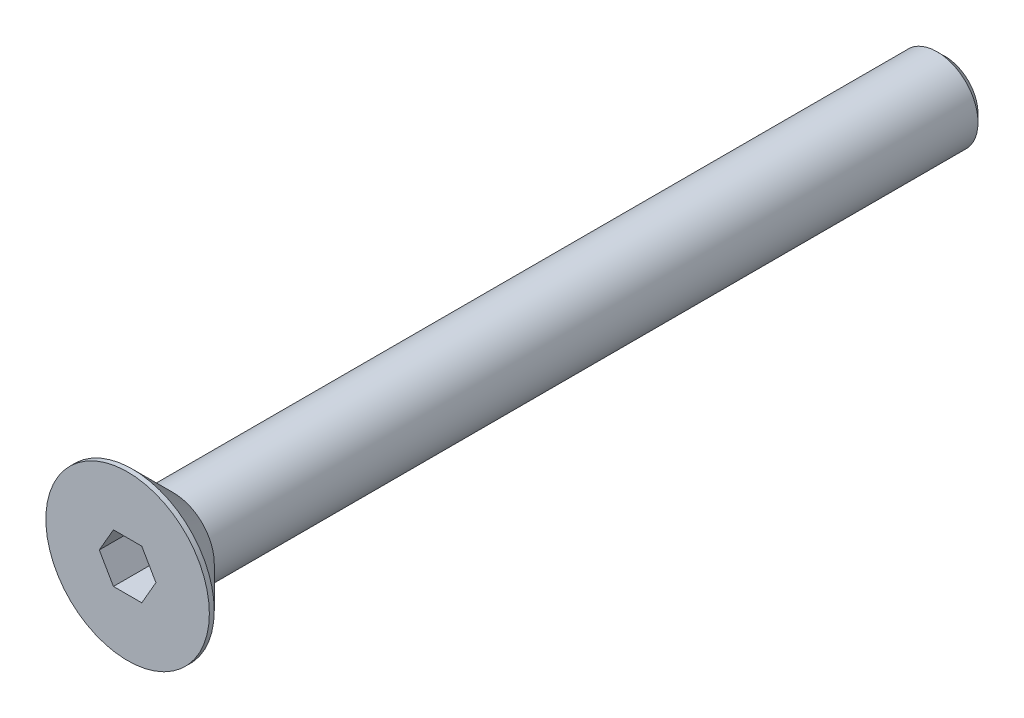
ISO-10303-21;
HEADER;
FILE_DESCRIPTION(('STEP AP214'),'2;1');
FILE_NAME('part.step','',(''),(''),'','','');
FILE_SCHEMA(('AUTOMOTIVE_DESIGN { 1 0 10303 214 1 1 1 1 }'));
ENDSEC;
DATA;
#1=APPLICATION_CONTEXT('core data for automotive mechanical design processes');
#2=APPLICATION_PROTOCOL_DEFINITION('international standard','automotive_design',2000,#1);
#3=PRODUCT_CONTEXT('',#1,'mechanical');
#4=PRODUCT('Part','Part','',(#3));
#5=PRODUCT_RELATED_PRODUCT_CATEGORY('part','',(#4));
#6=PRODUCT_DEFINITION_FORMATION('','',#4);
#7=PRODUCT_DEFINITION_CONTEXT('part definition',#1,'design');
#8=PRODUCT_DEFINITION('design','',#6,#7);
#9=PRODUCT_DEFINITION_SHAPE('','',#8);
#10=(LENGTH_UNIT() NAMED_UNIT(*) SI_UNIT(.MILLI.,.METRE.));
#11=(NAMED_UNIT(*) PLANE_ANGLE_UNIT() SI_UNIT($,.RADIAN.));
#12=(NAMED_UNIT(*) SI_UNIT($,.STERADIAN.) SOLID_ANGLE_UNIT());
#13=UNCERTAINTY_MEASURE_WITH_UNIT(LENGTH_MEASURE(1.E-05),#10,'distance_accuracy_value','');
#14=(GEOMETRIC_REPRESENTATION_CONTEXT(3) GLOBAL_UNCERTAINTY_ASSIGNED_CONTEXT((#13)) GLOBAL_UNIT_ASSIGNED_CONTEXT((#10,
#11,#12)) REPRESENTATION_CONTEXT('',''));
#15=CARTESIAN_POINT('',(0.,0.,0.));
#16=DIRECTION('',(0.,0.,1.));
#17=DIRECTION('',(1.,0.,0.));
#18=AXIS2_PLACEMENT_3D('',#15,#16,#17);
#19=CARTESIAN_POINT('',(0.,0.,-50.));
#20=DIRECTION('',(0.,0.,1.));
#21=DIRECTION('',(1.,0.,0.));
#22=AXIS2_PLACEMENT_3D('',#19,#20,#21);
#23=CYLINDRICAL_SURFACE('',#22,2.5);
#24=CARTESIAN_POINT('',(0.,0.,-49.50925));
#25=DIRECTION('',(0.,0.,-1.));
#26=DIRECTION('',(-1.,0.,0.));
#27=AXIS2_PLACEMENT_3D('',#24,#25,#26);
#28=CIRCLE('',#27,2.5);
#29=CARTESIAN_POINT('',(-2.5,0.,-49.50925));
#30=VERTEX_POINT('',#29);
#31=EDGE_CURVE('E40',#30,#30,#28,.F.);
#32=ORIENTED_EDGE('',*,*,#31,.T.);
#33=EDGE_LOOP('',(#32));
#34=FACE_BOUND('',#33,.T.);
#35=CARTESIAN_POINT('',(0.,0.,-2.80000000000001));
#36=DIRECTION('',(0.,0.,1.));
#37=DIRECTION('',(1.,0.,0.));
#38=AXIS2_PLACEMENT_3D('',#35,#36,#37);
#39=CIRCLE('',#38,2.5);
#40=CARTESIAN_POINT('',(2.5,0.,-2.80000000000001));
#41=VERTEX_POINT('',#40);
#42=EDGE_CURVE('E134',#41,#41,#39,.T.);
#43=ORIENTED_EDGE('',*,*,#42,.F.);
#44=EDGE_LOOP('',(#43));
#45=FACE_BOUND('',#44,.T.);
#46=ADVANCED_FACE('F32',(#34,#45),#23,.T.);
#47=CARTESIAN_POINT('',(2.5,0.,-50.));
#48=DIRECTION('',(0.,0.,-1.));
#49=DIRECTION('',(-1.,0.,0.));
#50=AXIS2_PLACEMENT_3D('',#47,#48,#49);
#51=PLANE('',#50);
#52=CARTESIAN_POINT('',(0.,0.,-50.));
#53=DIRECTION('',(0.,0.,-1.));
#54=DIRECTION('',(-1.,0.,0.));
#55=AXIS2_PLACEMENT_3D('',#52,#53,#54);
#56=CIRCLE('',#55,2.00925);
#57=CARTESIAN_POINT('',(-2.00925000000001,0.,-50.));
#58=VERTEX_POINT('',#57);
#59=EDGE_CURVE('E11',#58,#58,#56,.T.);
#60=ORIENTED_EDGE('',*,*,#59,.T.);
#61=EDGE_LOOP('',(#60));
#62=FACE_BOUND('',#61,.T.);
#63=ADVANCED_FACE('F161',(#62),#51,.T.);
#64=CARTESIAN_POINT('',(0.,0.,0.));
#65=DIRECTION('',(0.,0.,1.));
#66=DIRECTION('',(1.,0.,0.));
#67=AXIS2_PLACEMENT_3D('',#64,#65,#66);
#68=PLANE('',#67);
#69=DIRECTION('',(0.499999999999999,-0.866025403784439,0.));
#70=VECTOR('',#69,1.);
#71=CARTESIAN_POINT('',(-1.73205080756887,0.,0.));
#72=LINE('',#71,#70);
#73=CARTESIAN_POINT('',(-1.73205080756887,0.,0.));
#74=VERTEX_POINT('',#73);
#75=CARTESIAN_POINT('',(-0.866025403784439,-1.5,0.));
#76=VERTEX_POINT('',#75);
#77=EDGE_CURVE('E47',#74,#76,#72,.T.);
#78=ORIENTED_EDGE('',*,*,#77,.F.);
#79=DIRECTION('',(-0.499999999999999,-0.866025403784439,0.));
#80=VECTOR('',#79,1.);
#81=CARTESIAN_POINT('',(-0.866025403784439,1.5,0.));
#82=LINE('',#81,#80);
#83=CARTESIAN_POINT('',(-0.866025403784439,1.5,0.));
#84=VERTEX_POINT('',#83);
#85=EDGE_CURVE('E130',#84,#74,#82,.T.);
#86=ORIENTED_EDGE('',*,*,#85,.F.);
#87=DIRECTION('',(-1.,0.,0.));
#88=VECTOR('',#87,1.);
#89=CARTESIAN_POINT('',(0.866025403784439,1.5,0.));
#90=LINE('',#89,#88);
#91=CARTESIAN_POINT('',(0.866025403784439,1.5,0.));
#92=VERTEX_POINT('',#91);
#93=EDGE_CURVE('E128',#92,#84,#90,.T.);
#94=ORIENTED_EDGE('',*,*,#93,.F.);
#95=DIRECTION('',(-0.499999999999999,0.866025403784439,0.));
#96=VECTOR('',#95,1.);
#97=CARTESIAN_POINT('',(1.73205080756887,0.,0.));
#98=LINE('',#97,#96);
#99=CARTESIAN_POINT('',(1.73205080756887,0.,0.));
#100=VERTEX_POINT('',#99);
#101=EDGE_CURVE('E95',#100,#92,#98,.T.);
#102=ORIENTED_EDGE('',*,*,#101,.F.);
#103=DIRECTION('',(0.499999999999999,0.866025403784439,0.));
#104=VECTOR('',#103,1.);
#105=CARTESIAN_POINT('',(0.866025403784439,-1.5,0.));
#106=LINE('',#105,#104);
#107=CARTESIAN_POINT('',(0.866025403784439,-1.5,0.));
#108=VERTEX_POINT('',#107);
#109=EDGE_CURVE('E124',#108,#100,#106,.T.);
#110=ORIENTED_EDGE('',*,*,#109,.F.);
#111=DIRECTION('',(1.,0.,0.));
#112=VECTOR('',#111,1.);
#113=CARTESIAN_POINT('',(-0.866025403784439,-1.5,0.));
#114=LINE('',#113,#112);
#115=EDGE_CURVE('E121',#76,#108,#114,.T.);
#116=ORIENTED_EDGE('',*,*,#115,.F.);
#117=EDGE_LOOP('',(#78,#86,#94,#102,#110,#116));
#118=FACE_BOUND('',#117,.T.);
#119=CARTESIAN_POINT('',(0.,0.,0.));
#120=DIRECTION('',(0.,0.,1.));
#121=DIRECTION('',(1.,0.,0.));
#122=AXIS2_PLACEMENT_3D('',#119,#120,#121);
#123=CIRCLE('',#122,5.);
#124=CARTESIAN_POINT('',(5.,0.,0.));
#125=VERTEX_POINT('',#124);
#126=EDGE_CURVE('E145',#125,#125,#123,.T.);
#127=ORIENTED_EDGE('',*,*,#126,.T.);
#128=EDGE_LOOP('',(#127));
#129=FACE_BOUND('',#128,.T.);
#130=ADVANCED_FACE('F165',(#118,#129),#68,.T.);
#131=CARTESIAN_POINT('',(0.,0.,-50.));
#132=DIRECTION('',(0.,0.,1.));
#133=DIRECTION('',(1.,0.,0.));
#134=AXIS2_PLACEMENT_3D('',#131,#132,#133);
#135=CYLINDRICAL_SURFACE('',#134,5.);
#136=CARTESIAN_POINT('',(0.,0.,-0.300000000000009));
#137=DIRECTION('',(0.,0.,1.));
#138=DIRECTION('',(1.,0.,0.));
#139=AXIS2_PLACEMENT_3D('',#136,#137,#138);
#140=CIRCLE('',#139,5.);
#141=CARTESIAN_POINT('',(5.,0.,-0.300000000000009));
#142=VERTEX_POINT('',#141);
#143=EDGE_CURVE('E142',#142,#142,#140,.T.);
#144=ORIENTED_EDGE('',*,*,#143,.T.);
#145=EDGE_LOOP('',(#144));
#146=FACE_BOUND('',#145,.T.);
#147=ORIENTED_EDGE('',*,*,#126,.F.);
#148=EDGE_LOOP('',(#147));
#149=FACE_BOUND('',#148,.T.);
#150=ADVANCED_FACE('F171',(#146,#149),#135,.T.);
#151=CARTESIAN_POINT('',(0.,0.,-0.300000000000009));
#152=DIRECTION('',(0.,0.,1.));
#153=DIRECTION('',(1.,0.,0.));
#154=AXIS2_PLACEMENT_3D('',#151,#152,#153);
#155=CONICAL_SURFACE('',#154,5.,0.785398163397449);
#156=ORIENTED_EDGE('',*,*,#42,.T.);
#157=EDGE_LOOP('',(#156));
#158=FACE_BOUND('',#157,.T.);
#159=ORIENTED_EDGE('',*,*,#143,.F.);
#160=EDGE_LOOP('',(#159));
#161=FACE_BOUND('',#160,.T.);
#162=ADVANCED_FACE('F175',(#158,#161),#155,.T.);
#163=CARTESIAN_POINT('',(-1.73205080756887,0.,-3.3));
#164=DIRECTION('',(-0.866025403784439,-0.499999999999999,0.));
#165=DIRECTION('',(0.499999999999999,-0.866025403784439,0.));
#166=AXIS2_PLACEMENT_3D('',#163,#164,#165);
#167=PLANE('',#166);
#168=ORIENTED_EDGE('',*,*,#77,.T.);
#169=DIRECTION('',(0.,0.,1.));
#170=VECTOR('',#169,1.);
#171=CARTESIAN_POINT('',(-0.866025403784439,-1.5,-3.3));
#172=LINE('',#171,#170);
#173=CARTESIAN_POINT('',(-0.866025403784439,-1.5,-3.3));
#174=VERTEX_POINT('',#173);
#175=EDGE_CURVE('E77',#174,#76,#172,.T.);
#176=ORIENTED_EDGE('',*,*,#175,.F.);
#177=DIRECTION('',(0.499999999999999,-0.866025403784439,0.));
#178=VECTOR('',#177,1.);
#179=CARTESIAN_POINT('',(-1.73205080756887,0.,-3.3));
#180=LINE('',#179,#178);
#181=CARTESIAN_POINT('',(-1.73205080756887,0.,-3.3));
#182=VERTEX_POINT('',#181);
#183=EDGE_CURVE('E132',#182,#174,#180,.T.);
#184=ORIENTED_EDGE('',*,*,#183,.F.);
#185=DIRECTION('',(0.,0.,1.));
#186=VECTOR('',#185,1.);
#187=CARTESIAN_POINT('',(-1.73205080756887,0.,-3.3));
#188=LINE('',#187,#186);
#189=EDGE_CURVE('E55',#182,#74,#188,.T.);
#190=ORIENTED_EDGE('',*,*,#189,.T.);
#191=EDGE_LOOP('',(#168,#176,#184,#190));
#192=FACE_BOUND('',#191,.T.);
#193=ADVANCED_FACE('F179',(#192),#167,.F.);
#194=CARTESIAN_POINT('',(-0.866025403784439,1.5,-3.3));
#195=DIRECTION('',(-0.86602540378444,0.499999999999999,0.));
#196=DIRECTION('',(-0.499999999999999,-0.866025403784439,0.));
#197=AXIS2_PLACEMENT_3D('',#194,#195,#196);
#198=PLANE('',#197);
#199=ORIENTED_EDGE('',*,*,#85,.T.);
#200=ORIENTED_EDGE('',*,*,#189,.F.);
#201=DIRECTION('',(-0.499999999999999,-0.866025403784439,0.));
#202=VECTOR('',#201,1.);
#203=CARTESIAN_POINT('',(-0.866025403784439,1.5,-3.3));
#204=LINE('',#203,#202);
#205=CARTESIAN_POINT('',(-0.866025403784439,1.5,-3.3));
#206=VERTEX_POINT('',#205);
#207=EDGE_CURVE('E107',#206,#182,#204,.T.);
#208=ORIENTED_EDGE('',*,*,#207,.F.);
#209=DIRECTION('',(0.,0.,1.));
#210=VECTOR('',#209,1.);
#211=CARTESIAN_POINT('',(-0.866025403784439,1.5,-3.3));
#212=LINE('',#211,#210);
#213=EDGE_CURVE('E99',#206,#84,#212,.T.);
#214=ORIENTED_EDGE('',*,*,#213,.T.);
#215=EDGE_LOOP('',(#199,#200,#208,#214));
#216=FACE_BOUND('',#215,.T.);
#217=ADVANCED_FACE('F183',(#216),#198,.F.);
#218=CARTESIAN_POINT('',(0.866025403784439,1.5,-3.3));
#219=DIRECTION('',(0.,1.,0.));
#220=DIRECTION('',(0.,0.,1.));
#221=AXIS2_PLACEMENT_3D('',#218,#219,#220);
#222=PLANE('',#221);
#223=ORIENTED_EDGE('',*,*,#93,.T.);
#224=ORIENTED_EDGE('',*,*,#213,.F.);
#225=DIRECTION('',(-1.,0.,0.));
#226=VECTOR('',#225,1.);
#227=CARTESIAN_POINT('',(0.866025403784439,1.5,-3.3));
#228=LINE('',#227,#226);
#229=CARTESIAN_POINT('',(0.866025403784439,1.5,-3.3));
#230=VERTEX_POINT('',#229);
#231=EDGE_CURVE('E103',#230,#206,#228,.T.);
#232=ORIENTED_EDGE('',*,*,#231,.F.);
#233=DIRECTION('',(0.,0.,1.));
#234=VECTOR('',#233,1.);
#235=CARTESIAN_POINT('',(0.866025403784439,1.5,-3.3));
#236=LINE('',#235,#234);
#237=EDGE_CURVE('E88',#230,#92,#236,.T.);
#238=ORIENTED_EDGE('',*,*,#237,.T.);
#239=EDGE_LOOP('',(#223,#224,#232,#238));
#240=FACE_BOUND('',#239,.T.);
#241=ADVANCED_FACE('F104',(#240),#222,.F.);
#242=CARTESIAN_POINT('',(1.73205080756887,0.,-3.3));
#243=DIRECTION('',(0.866025403784439,0.499999999999999,0.));
#244=DIRECTION('',(-0.499999999999999,0.866025403784439,0.));
#245=AXIS2_PLACEMENT_3D('',#242,#243,#244);
#246=PLANE('',#245);
#247=ORIENTED_EDGE('',*,*,#101,.T.);
#248=ORIENTED_EDGE('',*,*,#237,.F.);
#249=DIRECTION('',(-0.499999999999999,0.866025403784439,0.));
#250=VECTOR('',#249,1.);
#251=CARTESIAN_POINT('',(1.73205080756887,0.,-3.3));
#252=LINE('',#251,#250);
#253=CARTESIAN_POINT('',(1.73205080756887,0.,-3.3));
#254=VERTEX_POINT('',#253);
#255=EDGE_CURVE('E92',#254,#230,#252,.T.);
#256=ORIENTED_EDGE('',*,*,#255,.F.);
#257=DIRECTION('',(0.,0.,1.));
#258=VECTOR('',#257,1.);
#259=CARTESIAN_POINT('',(1.73205080756887,0.,-3.3));
#260=LINE('',#259,#258);
#261=EDGE_CURVE('E100',#254,#100,#260,.T.);
#262=ORIENTED_EDGE('',*,*,#261,.T.);
#263=EDGE_LOOP('',(#247,#248,#256,#262));
#264=FACE_BOUND('',#263,.T.);
#265=ADVANCED_FACE('F90',(#264),#246,.F.);
#266=CARTESIAN_POINT('',(0.866025403784439,-1.5,-3.3));
#267=DIRECTION('',(0.86602540378444,-0.499999999999999,0.));
#268=DIRECTION('',(0.499999999999999,0.86602540378444,0.));
#269=AXIS2_PLACEMENT_3D('',#266,#267,#268);
#270=PLANE('',#269);
#271=ORIENTED_EDGE('',*,*,#109,.T.);
#272=ORIENTED_EDGE('',*,*,#261,.F.);
#273=DIRECTION('',(0.499999999999999,0.866025403784439,0.));
#274=VECTOR('',#273,1.);
#275=CARTESIAN_POINT('',(0.866025403784439,-1.5,-3.3));
#276=LINE('',#275,#274);
#277=CARTESIAN_POINT('',(0.866025403784439,-1.5,-3.3));
#278=VERTEX_POINT('',#277);
#279=EDGE_CURVE('E113',#278,#254,#276,.T.);
#280=ORIENTED_EDGE('',*,*,#279,.F.);
#281=DIRECTION('',(0.,0.,1.));
#282=VECTOR('',#281,1.);
#283=CARTESIAN_POINT('',(0.866025403784439,-1.5,-3.3));
#284=LINE('',#283,#282);
#285=EDGE_CURVE('E137',#278,#108,#284,.T.);
#286=ORIENTED_EDGE('',*,*,#285,.T.);
#287=EDGE_LOOP('',(#271,#272,#280,#286));
#288=FACE_BOUND('',#287,.T.);
#289=ADVANCED_FACE('F186',(#288),#270,.F.);
#290=CARTESIAN_POINT('',(-0.866025403784439,-1.5,-3.3));
#291=DIRECTION('',(0.,-1.,0.));
#292=DIRECTION('',(0.,0.,-1.));
#293=AXIS2_PLACEMENT_3D('',#290,#291,#292);
#294=PLANE('',#293);
#295=ORIENTED_EDGE('',*,*,#115,.T.);
#296=ORIENTED_EDGE('',*,*,#285,.F.);
#297=DIRECTION('',(1.,0.,0.));
#298=VECTOR('',#297,1.);
#299=CARTESIAN_POINT('',(-0.866025403784439,-1.5,-3.3));
#300=LINE('',#299,#298);
#301=EDGE_CURVE('E115',#174,#278,#300,.T.);
#302=ORIENTED_EDGE('',*,*,#301,.F.);
#303=ORIENTED_EDGE('',*,*,#175,.T.);
#304=EDGE_LOOP('',(#295,#296,#302,#303));
#305=FACE_BOUND('',#304,.T.);
#306=ADVANCED_FACE('F157',(#305),#294,.F.);
#307=CARTESIAN_POINT('',(0.,0.,-3.3));
#308=DIRECTION('',(0.,0.,1.));
#309=DIRECTION('',(1.,0.,0.));
#310=AXIS2_PLACEMENT_3D('',#307,#308,#309);
#311=PLANE('',#310);
#312=ORIENTED_EDGE('',*,*,#183,.T.);
#313=ORIENTED_EDGE('',*,*,#301,.T.);
#314=ORIENTED_EDGE('',*,*,#279,.T.);
#315=ORIENTED_EDGE('',*,*,#255,.T.);
#316=ORIENTED_EDGE('',*,*,#231,.T.);
#317=ORIENTED_EDGE('',*,*,#207,.T.);
#318=EDGE_LOOP('',(#312,#313,#314,#315,#316,#317));
#319=FACE_BOUND('',#318,.T.);
#320=ADVANCED_FACE('F110',(#319),#311,.T.);
#321=CARTESIAN_POINT('',(0.,0.,-49.50925));
#322=DIRECTION('',(0.,0.,1.));
#323=DIRECTION('',(1.,0.,0.));
#324=AXIS2_PLACEMENT_3D('',#321,#322,#323);
#325=CONICAL_SURFACE('',#324,2.5,0.785398163397445);
#326=ORIENTED_EDGE('',*,*,#59,.F.);
#327=EDGE_LOOP('',(#326));
#328=FACE_BOUND('',#327,.T.);
#329=ORIENTED_EDGE('',*,*,#31,.F.);
#330=EDGE_LOOP('',(#329));
#331=FACE_BOUND('',#330,.T.);
#332=ADVANCED_FACE('F34',(#328,#331),#325,.T.);
#333=CLOSED_SHELL('',(#46,#63,#130,#150,#162,#193,#217,#241,#265,#289,#306,#320,#332));
#334=MANIFOLD_SOLID_BREP('B2',#333);
#335=ADVANCED_BREP_SHAPE_REPRESENTATION('',(#18,#334),#14);
#336=SHAPE_DEFINITION_REPRESENTATION(#9,#335);
ENDSEC;
END-ISO-10303-21;
